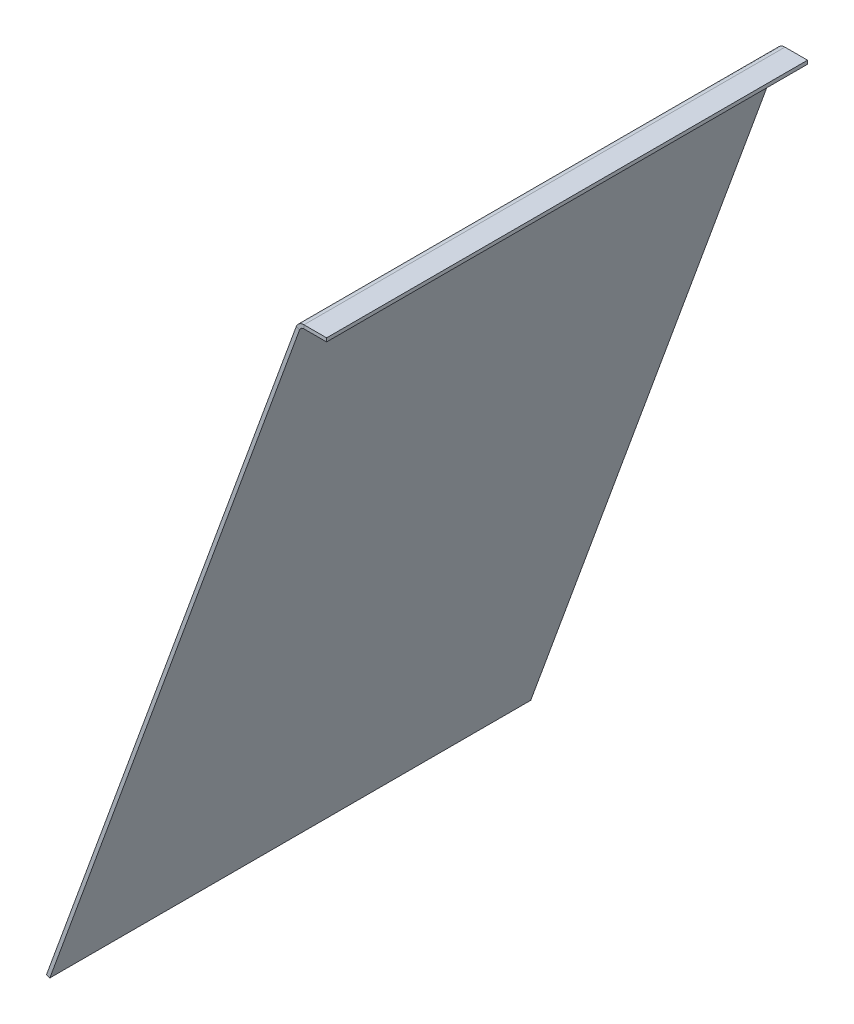
ISO-10303-21;
HEADER;
FILE_DESCRIPTION(('STEP AP214'),'2;1');
FILE_NAME('part.step','',(''),(''),'','','');
FILE_SCHEMA(('AUTOMOTIVE_DESIGN { 1 0 10303 214 1 1 1 1 }'));
ENDSEC;
DATA;
#1=APPLICATION_CONTEXT('core data for automotive mechanical design processes');
#2=APPLICATION_PROTOCOL_DEFINITION('international standard','automotive_design',2000,#1);
#3=PRODUCT_CONTEXT('',#1,'mechanical');
#4=PRODUCT('Part','Part','',(#3));
#5=PRODUCT_RELATED_PRODUCT_CATEGORY('part','',(#4));
#6=PRODUCT_DEFINITION_FORMATION('','',#4);
#7=PRODUCT_DEFINITION_CONTEXT('part definition',#1,'design');
#8=PRODUCT_DEFINITION('design','',#6,#7);
#9=PRODUCT_DEFINITION_SHAPE('','',#8);
#10=(LENGTH_UNIT() NAMED_UNIT(*) SI_UNIT(.MILLI.,.METRE.));
#11=(NAMED_UNIT(*) PLANE_ANGLE_UNIT() SI_UNIT($,.RADIAN.));
#12=(NAMED_UNIT(*) SI_UNIT($,.STERADIAN.) SOLID_ANGLE_UNIT());
#13=UNCERTAINTY_MEASURE_WITH_UNIT(LENGTH_MEASURE(1.E-05),#10,'distance_accuracy_value','');
#14=(GEOMETRIC_REPRESENTATION_CONTEXT(3) GLOBAL_UNCERTAINTY_ASSIGNED_CONTEXT((#13)) GLOBAL_UNIT_ASSIGNED_CONTEXT((#10,
#11,#12)) REPRESENTATION_CONTEXT('',''));
#15=CARTESIAN_POINT('',(0.,0.,0.));
#16=DIRECTION('',(0.,0.,1.));
#17=DIRECTION('',(1.,0.,0.));
#18=AXIS2_PLACEMENT_3D('',#15,#16,#17);
#19=CARTESIAN_POINT('',(-1.97245113425819E-13,-133.5,-417.352278085913));
#20=DIRECTION('',(-1.,0.,0.));
#21=DIRECTION('',(0.,0.,1.));
#22=AXIS2_PLACEMENT_3D('',#19,#20,#21);
#23=PLANE('',#22);
#24=DIRECTION('',(0.,-1.,0.));
#25=VECTOR('',#24,1.);
#26=CARTESIAN_POINT('',(-1.97245113425819E-13,-133.5,-101.6));
#27=LINE('',#26,#25);
#28=CARTESIAN_POINT('',(-1.97245113425819E-13,-132.,-101.6));
#29=VERTEX_POINT('',#28);
#30=CARTESIAN_POINT('',(-1.97245113425819E-13,-133.5,-101.6));
#31=VERTEX_POINT('',#30);
#32=EDGE_CURVE('E11',#29,#31,#27,.T.);
#33=ORIENTED_EDGE('',*,*,#32,.F.);
#34=DIRECTION('',(0.,0.,1.));
#35=VECTOR('',#34,1.);
#36=CARTESIAN_POINT('',(-1.97245113425819E-13,-132.,-417.352278085913));
#37=LINE('',#36,#35);
#38=CARTESIAN_POINT('',(-1.97245113425819E-13,-132.,101.6));
#39=VERTEX_POINT('',#38);
#40=EDGE_CURVE('E91',#29,#39,#37,.T.);
#41=ORIENTED_EDGE('',*,*,#40,.T.);
#42=DIRECTION('',(0.,-1.,0.));
#43=VECTOR('',#42,1.);
#44=CARTESIAN_POINT('',(-1.97245113425819E-13,-133.5,101.6));
#45=LINE('',#44,#43);
#46=CARTESIAN_POINT('',(-1.97245113425819E-13,-133.5,101.6));
#47=VERTEX_POINT('',#46);
#48=EDGE_CURVE('E52',#39,#47,#45,.T.);
#49=ORIENTED_EDGE('',*,*,#48,.T.);
#50=DIRECTION('',(0.,0.,1.));
#51=VECTOR('',#50,1.);
#52=CARTESIAN_POINT('',(-1.97245113425819E-13,-133.5,-417.352278085913));
#53=LINE('',#52,#51);
#54=EDGE_CURVE('E93',#31,#47,#53,.T.);
#55=ORIENTED_EDGE('',*,*,#54,.F.);
#56=EDGE_LOOP('',(#33,#41,#49,#55));
#57=FACE_BOUND('',#56,.T.);
#58=ADVANCED_FACE('F41',(#57),#23,.F.);
#59=CARTESIAN_POINT('',(-1.97245113425819E-13,-133.5,101.6));
#60=DIRECTION('',(0.,0.,1.));
#61=DIRECTION('',(1.,0.,0.));
#62=AXIS2_PLACEMENT_3D('',#59,#60,#61);
#63=PLANE('',#62);
#64=ORIENTED_EDGE('',*,*,#48,.F.);
#65=DIRECTION('',(1.,0.,0.));
#66=VECTOR('',#65,1.);
#67=CARTESIAN_POINT('',(-1.97245113425819E-13,-132.,101.6));
#68=LINE('',#67,#66);
#69=CARTESIAN_POINT('',(-9.54927361626621,-132.,101.6));
#70=VERTEX_POINT('',#69);
#71=EDGE_CURVE('E106',#39,#70,#68,.F.);
#72=ORIENTED_EDGE('',*,*,#71,.T.);
#73=DIRECTION('',(0.,-1.,0.));
#74=VECTOR('',#73,1.);
#75=CARTESIAN_POINT('',(-9.54927361626621,-133.5,101.6));
#76=LINE('',#75,#74);
#77=CARTESIAN_POINT('',(-9.54927361626621,-133.5,101.6));
#78=VERTEX_POINT('',#77);
#79=EDGE_CURVE('E130',#70,#78,#76,.T.);
#80=ORIENTED_EDGE('',*,*,#79,.T.);
#81=DIRECTION('',(1.,0.,0.));
#82=VECTOR('',#81,1.);
#83=CARTESIAN_POINT('',(-1.97245113425819E-13,-133.5,101.6));
#84=LINE('',#83,#82);
#85=EDGE_CURVE('E145',#47,#78,#84,.F.);
#86=ORIENTED_EDGE('',*,*,#85,.F.);
#87=EDGE_LOOP('',(#64,#72,#80,#86));
#88=FACE_BOUND('',#87,.T.);
#89=ADVANCED_FACE('F150',(#88),#63,.T.);
#90=CARTESIAN_POINT('',(-9.54927361626621,-135.5,101.6));
#91=DIRECTION('',(0.,0.,-1.));
#92=DIRECTION('',(-1.,0.,0.));
#93=AXIS2_PLACEMENT_3D('',#90,#91,#92);
#94=PLANE('',#93);
#95=ORIENTED_EDGE('',*,*,#79,.F.);
#96=CARTESIAN_POINT('',(-9.54927361626621,-135.5,101.6));
#97=DIRECTION('',(0.,0.,1.));
#98=DIRECTION('',(1.,0.,0.));
#99=AXIS2_PLACEMENT_3D('',#96,#97,#98);
#100=CIRCLE('',#99,3.5);
#101=CARTESIAN_POINT('',(-12.8381977890169,-134.30292949836,101.6));
#102=VERTEX_POINT('',#101);
#103=EDGE_CURVE('E196',#70,#102,#100,.T.);
#104=ORIENTED_EDGE('',*,*,#103,.T.);
#105=DIRECTION('',(0.939692620785909,-0.342020143325666,0.));
#106=VECTOR('',#105,1.);
#107=CARTESIAN_POINT('',(-11.428658857838,-134.815959713349,101.6));
#108=LINE('',#107,#106);
#109=CARTESIAN_POINT('',(-11.428658857838,-134.815959713349,101.6));
#110=VERTEX_POINT('',#109);
#111=EDGE_CURVE('E126',#102,#110,#108,.T.);
#112=ORIENTED_EDGE('',*,*,#111,.T.);
#113=CARTESIAN_POINT('',(-9.54927361626621,-135.5,101.6));
#114=DIRECTION('',(0.,0.,1.));
#115=DIRECTION('',(1.,0.,0.));
#116=AXIS2_PLACEMENT_3D('',#113,#114,#115);
#117=CIRCLE('',#116,2.);
#118=EDGE_CURVE('E179',#78,#110,#117,.T.);
#119=ORIENTED_EDGE('',*,*,#118,.F.);
#120=EDGE_LOOP('',(#95,#104,#112,#119));
#121=FACE_BOUND('',#120,.T.);
#122=ADVANCED_FACE('F217',(#121),#94,.F.);
#123=CARTESIAN_POINT('',(-10.5904610688213,-132.513030214989,101.6));
#124=DIRECTION('',(0.,0.,-1.));
#125=DIRECTION('',(-0.342020143325666,-0.939692620785909,0.));
#126=AXIS2_PLACEMENT_3D('',#123,#124,#125);
#127=PLANE('',#126);
#128=ORIENTED_EDGE('',*,*,#111,.F.);
#129=DIRECTION('',(-0.342020143325666,-0.939692620785909,0.));
#130=VECTOR('',#129,1.);
#131=CARTESIAN_POINT('',(-12.0000000000002,-132.,101.6));
#132=LINE('',#131,#130);
#133=CARTESIAN_POINT('',(-118.358260534745,-424.216919191684,101.6));
#134=VERTEX_POINT('',#133);
#135=EDGE_CURVE('E191',#102,#134,#132,.T.);
#136=ORIENTED_EDGE('',*,*,#135,.T.);
#137=DIRECTION('',(0.939692620785909,-0.342020143325666,0.));
#138=VECTOR('',#137,1.);
#139=CARTESIAN_POINT('',(-116.948721603566,-424.729949406673,101.6));
#140=LINE('',#139,#138);
#141=CARTESIAN_POINT('',(-116.948721603566,-424.729949406673,101.6));
#142=VERTEX_POINT('',#141);
#143=EDGE_CURVE('E123',#134,#142,#140,.T.);
#144=ORIENTED_EDGE('',*,*,#143,.T.);
#145=DIRECTION('',(-0.342020143325666,-0.939692620785909,0.));
#146=VECTOR('',#145,1.);
#147=CARTESIAN_POINT('',(-10.5904610688213,-132.513030214989,101.6));
#148=LINE('',#147,#146);
#149=EDGE_CURVE('E168',#110,#142,#148,.T.);
#150=ORIENTED_EDGE('',*,*,#149,.F.);
#151=EDGE_LOOP('',(#128,#136,#144,#150));
#152=FACE_BOUND('',#151,.T.);
#153=ADVANCED_FACE('F254',(#152),#127,.F.);
#154=CARTESIAN_POINT('',(-116.948721603566,-424.729949406673,-417.352278085913));
#155=DIRECTION('',(-0.342020143325666,-0.939692620785909,0.));
#156=DIRECTION('',(0.,0.,1.));
#157=AXIS2_PLACEMENT_3D('',#154,#155,#156);
#158=PLANE('',#157);
#159=ORIENTED_EDGE('',*,*,#143,.F.);
#160=DIRECTION('',(0.,0.,1.));
#161=VECTOR('',#160,1.);
#162=CARTESIAN_POINT('',(-118.358260534745,-424.216919191684,-417.352278085913));
#163=LINE('',#162,#161);
#164=CARTESIAN_POINT('',(-118.358260534745,-424.216919191684,-101.6));
#165=VERTEX_POINT('',#164);
#166=EDGE_CURVE('E197',#165,#134,#163,.T.);
#167=ORIENTED_EDGE('',*,*,#166,.F.);
#168=DIRECTION('',(0.939692620785909,-0.342020143325666,0.));
#169=VECTOR('',#168,1.);
#170=CARTESIAN_POINT('',(-116.948721603566,-424.729949406673,-101.6));
#171=LINE('',#170,#169);
#172=CARTESIAN_POINT('',(-116.948721603566,-424.729949406673,-101.6));
#173=VERTEX_POINT('',#172);
#174=EDGE_CURVE('E60',#165,#173,#171,.T.);
#175=ORIENTED_EDGE('',*,*,#174,.T.);
#176=DIRECTION('',(0.,0.,1.));
#177=VECTOR('',#176,1.);
#178=CARTESIAN_POINT('',(-116.948721603566,-424.729949406673,-417.352278085913));
#179=LINE('',#178,#177);
#180=EDGE_CURVE('E172',#173,#142,#179,.T.);
#181=ORIENTED_EDGE('',*,*,#180,.T.);
#182=EDGE_LOOP('',(#159,#167,#175,#181));
#183=FACE_BOUND('',#182,.T.);
#184=ADVANCED_FACE('F243',(#183),#158,.T.);
#185=CARTESIAN_POINT('',(-10.5904610688213,-132.513030214989,-101.6));
#186=DIRECTION('',(0.,0.,-1.));
#187=DIRECTION('',(-0.342020143325666,-0.939692620785909,0.));
#188=AXIS2_PLACEMENT_3D('',#185,#186,#187);
#189=PLANE('',#188);
#190=ORIENTED_EDGE('',*,*,#174,.F.);
#191=DIRECTION('',(-0.342020143325666,-0.939692620785909,0.));
#192=VECTOR('',#191,1.);
#193=CARTESIAN_POINT('',(-12.0000000000002,-132.,-101.6));
#194=LINE('',#193,#192);
#195=CARTESIAN_POINT('',(-12.8381977890169,-134.30292949836,-101.6));
#196=VERTEX_POINT('',#195);
#197=EDGE_CURVE('E186',#196,#165,#194,.T.);
#198=ORIENTED_EDGE('',*,*,#197,.F.);
#199=DIRECTION('',(0.939692620785909,-0.342020143325669,0.));
#200=VECTOR('',#199,1.);
#201=CARTESIAN_POINT('',(-11.428658857838,-134.815959713349,-101.6));
#202=LINE('',#201,#200);
#203=CARTESIAN_POINT('',(-11.428658857838,-134.815959713349,-101.6));
#204=VERTEX_POINT('',#203);
#205=EDGE_CURVE('E117',#196,#204,#202,.T.);
#206=ORIENTED_EDGE('',*,*,#205,.T.);
#207=DIRECTION('',(-0.342020143325666,-0.939692620785909,0.));
#208=VECTOR('',#207,1.);
#209=CARTESIAN_POINT('',(-10.5904610688213,-132.513030214989,-101.6));
#210=LINE('',#209,#208);
#211=EDGE_CURVE('E157',#204,#173,#210,.T.);
#212=ORIENTED_EDGE('',*,*,#211,.T.);
#213=EDGE_LOOP('',(#190,#198,#206,#212));
#214=FACE_BOUND('',#213,.T.);
#215=ADVANCED_FACE('F233',(#214),#189,.T.);
#216=CARTESIAN_POINT('',(-9.54927361626621,-135.5,-101.6));
#217=DIRECTION('',(0.,0.,1.));
#218=DIRECTION('',(1.,0.,0.));
#219=AXIS2_PLACEMENT_3D('',#216,#217,#218);
#220=PLANE('',#219);
#221=ORIENTED_EDGE('',*,*,#205,.F.);
#222=CARTESIAN_POINT('',(-9.54927361626621,-135.5,-101.6));
#223=DIRECTION('',(0.,0.,1.));
#224=DIRECTION('',(1.,0.,0.));
#225=AXIS2_PLACEMENT_3D('',#222,#223,#224);
#226=CIRCLE('',#225,3.5);
#227=CARTESIAN_POINT('',(-9.54927361626621,-132.,-101.6));
#228=VERTEX_POINT('',#227);
#229=EDGE_CURVE('E192',#228,#196,#226,.T.);
#230=ORIENTED_EDGE('',*,*,#229,.F.);
#231=DIRECTION('',(0.,-1.,0.));
#232=VECTOR('',#231,1.);
#233=CARTESIAN_POINT('',(-9.54927361626621,-133.5,-101.6));
#234=LINE('',#233,#232);
#235=CARTESIAN_POINT('',(-9.54927361626621,-133.5,-101.6));
#236=VERTEX_POINT('',#235);
#237=EDGE_CURVE('E45',#228,#236,#234,.T.);
#238=ORIENTED_EDGE('',*,*,#237,.T.);
#239=CARTESIAN_POINT('',(-9.54927361626621,-135.5,-101.6));
#240=DIRECTION('',(0.,0.,-1.));
#241=DIRECTION('',(-1.,0.,0.));
#242=AXIS2_PLACEMENT_3D('',#239,#240,#241);
#243=CIRCLE('',#242,2.);
#244=EDGE_CURVE('E175',#236,#204,#243,.F.);
#245=ORIENTED_EDGE('',*,*,#244,.T.);
#246=EDGE_LOOP('',(#221,#230,#238,#245));
#247=FACE_BOUND('',#246,.T.);
#248=ADVANCED_FACE('F236',(#247),#220,.F.);
#249=CARTESIAN_POINT('',(-1.97245113425819E-13,-133.5,-101.6));
#250=DIRECTION('',(0.,0.,-1.));
#251=DIRECTION('',(-1.,0.,0.));
#252=AXIS2_PLACEMENT_3D('',#249,#250,#251);
#253=PLANE('',#252);
#254=DIRECTION('',(1.,0.,0.));
#255=VECTOR('',#254,1.);
#256=CARTESIAN_POINT('',(-1.97245113425819E-13,-132.,-101.6));
#257=LINE('',#256,#255);
#258=EDGE_CURVE('E103',#29,#228,#257,.F.);
#259=ORIENTED_EDGE('',*,*,#258,.F.);
#260=ORIENTED_EDGE('',*,*,#32,.T.);
#261=DIRECTION('',(-1.,0.,0.));
#262=VECTOR('',#261,1.);
#263=CARTESIAN_POINT('',(-1.97245113425819E-13,-133.5,-101.6));
#264=LINE('',#263,#262);
#265=EDGE_CURVE('E147',#31,#236,#264,.T.);
#266=ORIENTED_EDGE('',*,*,#265,.T.);
#267=ORIENTED_EDGE('',*,*,#237,.F.);
#268=EDGE_LOOP('',(#259,#260,#266,#267));
#269=FACE_BOUND('',#268,.T.);
#270=ADVANCED_FACE('F43',(#269),#253,.T.);
#271=CARTESIAN_POINT('',(-9.54927361626621,-135.5,-417.352278085913));
#272=DIRECTION('',(0.,0.,1.));
#273=DIRECTION('',(1.,0.,0.));
#274=AXIS2_PLACEMENT_3D('',#271,#272,#273);
#275=CYLINDRICAL_SURFACE('',#274,2.);
#276=ORIENTED_EDGE('',*,*,#244,.F.);
#277=DIRECTION('',(0.,0.,1.));
#278=VECTOR('',#277,1.);
#279=CARTESIAN_POINT('',(-9.54927361626621,-133.5,-417.352278085913));
#280=LINE('',#279,#278);
#281=EDGE_CURVE('E152',#236,#78,#280,.T.);
#282=ORIENTED_EDGE('',*,*,#281,.T.);
#283=ORIENTED_EDGE('',*,*,#118,.T.);
#284=DIRECTION('',(0.,0.,1.));
#285=VECTOR('',#284,1.);
#286=CARTESIAN_POINT('',(-11.428658857838,-134.815959713349,-417.352278085913));
#287=LINE('',#286,#285);
#288=EDGE_CURVE('E164',#204,#110,#287,.T.);
#289=ORIENTED_EDGE('',*,*,#288,.F.);
#290=EDGE_LOOP('',(#276,#282,#283,#289));
#291=FACE_BOUND('',#290,.T.);
#292=ADVANCED_FACE('F224',(#291),#275,.F.);
#293=CARTESIAN_POINT('',(-10.5904610688213,-132.513030214989,-417.352278085913));
#294=DIRECTION('',(-0.939692620785909,0.342020143325666,0.));
#295=DIRECTION('',(-0.342020143325666,-0.939692620785909,0.));
#296=AXIS2_PLACEMENT_3D('',#293,#294,#295);
#297=PLANE('',#296);
#298=ORIENTED_EDGE('',*,*,#211,.F.);
#299=ORIENTED_EDGE('',*,*,#288,.T.);
#300=ORIENTED_EDGE('',*,*,#149,.T.);
#301=ORIENTED_EDGE('',*,*,#180,.F.);
#302=EDGE_LOOP('',(#298,#299,#300,#301));
#303=FACE_BOUND('',#302,.T.);
#304=ADVANCED_FACE('F235',(#303),#297,.F.);
#305=CARTESIAN_POINT('',(-1.97245113425819E-13,-133.5,-417.352278085913));
#306=DIRECTION('',(0.,1.,0.));
#307=DIRECTION('',(0.,0.,1.));
#308=AXIS2_PLACEMENT_3D('',#305,#306,#307);
#309=PLANE('',#308);
#310=ORIENTED_EDGE('',*,*,#265,.F.);
#311=ORIENTED_EDGE('',*,*,#54,.T.);
#312=ORIENTED_EDGE('',*,*,#85,.T.);
#313=ORIENTED_EDGE('',*,*,#281,.F.);
#314=EDGE_LOOP('',(#310,#311,#312,#313));
#315=FACE_BOUND('',#314,.T.);
#316=ADVANCED_FACE('F143',(#315),#309,.F.);
#317=CARTESIAN_POINT('',(-9.54927361626621,-135.5,-417.352278085913));
#318=DIRECTION('',(0.,0.,1.));
#319=DIRECTION('',(1.,0.,0.));
#320=AXIS2_PLACEMENT_3D('',#317,#318,#319);
#321=CYLINDRICAL_SURFACE('',#320,3.5);
#322=ORIENTED_EDGE('',*,*,#229,.T.);
#323=DIRECTION('',(0.,0.,1.));
#324=VECTOR('',#323,1.);
#325=CARTESIAN_POINT('',(-12.8381977890169,-134.30292949836,-417.352278085913));
#326=LINE('',#325,#324);
#327=EDGE_CURVE('E187',#196,#102,#326,.T.);
#328=ORIENTED_EDGE('',*,*,#327,.T.);
#329=ORIENTED_EDGE('',*,*,#103,.F.);
#330=DIRECTION('',(0.,0.,1.));
#331=VECTOR('',#330,1.);
#332=CARTESIAN_POINT('',(-9.54927361626621,-132.,-417.352278085913));
#333=LINE('',#332,#331);
#334=EDGE_CURVE('E183',#228,#70,#333,.T.);
#335=ORIENTED_EDGE('',*,*,#334,.F.);
#336=EDGE_LOOP('',(#322,#328,#329,#335));
#337=FACE_BOUND('',#336,.T.);
#338=ADVANCED_FACE('F213',(#337),#321,.T.);
#339=CARTESIAN_POINT('',(-12.0000000000002,-132.,-417.352278085913));
#340=DIRECTION('',(-0.939692620785909,0.342020143325666,0.));
#341=DIRECTION('',(-0.342020143325666,-0.939692620785909,0.));
#342=AXIS2_PLACEMENT_3D('',#339,#340,#341);
#343=PLANE('',#342);
#344=ORIENTED_EDGE('',*,*,#197,.T.);
#345=ORIENTED_EDGE('',*,*,#166,.T.);
#346=ORIENTED_EDGE('',*,*,#135,.F.);
#347=ORIENTED_EDGE('',*,*,#327,.F.);
#348=EDGE_LOOP('',(#344,#345,#346,#347));
#349=FACE_BOUND('',#348,.T.);
#350=ADVANCED_FACE('F262',(#349),#343,.T.);
#351=CARTESIAN_POINT('',(-1.97245113425819E-13,-132.,-417.352278085913));
#352=DIRECTION('',(0.,1.,0.));
#353=DIRECTION('',(0.,0.,1.));
#354=AXIS2_PLACEMENT_3D('',#351,#352,#353);
#355=PLANE('',#354);
#356=ORIENTED_EDGE('',*,*,#258,.T.);
#357=ORIENTED_EDGE('',*,*,#334,.T.);
#358=ORIENTED_EDGE('',*,*,#71,.F.);
#359=ORIENTED_EDGE('',*,*,#40,.F.);
#360=EDGE_LOOP('',(#356,#357,#358,#359));
#361=FACE_BOUND('',#360,.T.);
#362=ADVANCED_FACE('F101',(#361),#355,.T.);
#363=CLOSED_SHELL('',(#58,#89,#122,#153,#184,#215,#248,#270,#292,#304,#316,#338,#350,#362));
#364=MANIFOLD_SOLID_BREP('B2',#363);
#365=ADVANCED_BREP_SHAPE_REPRESENTATION('',(#18,#364),#14);
#366=SHAPE_DEFINITION_REPRESENTATION(#9,#365);
ENDSEC;
END-ISO-10303-21;
